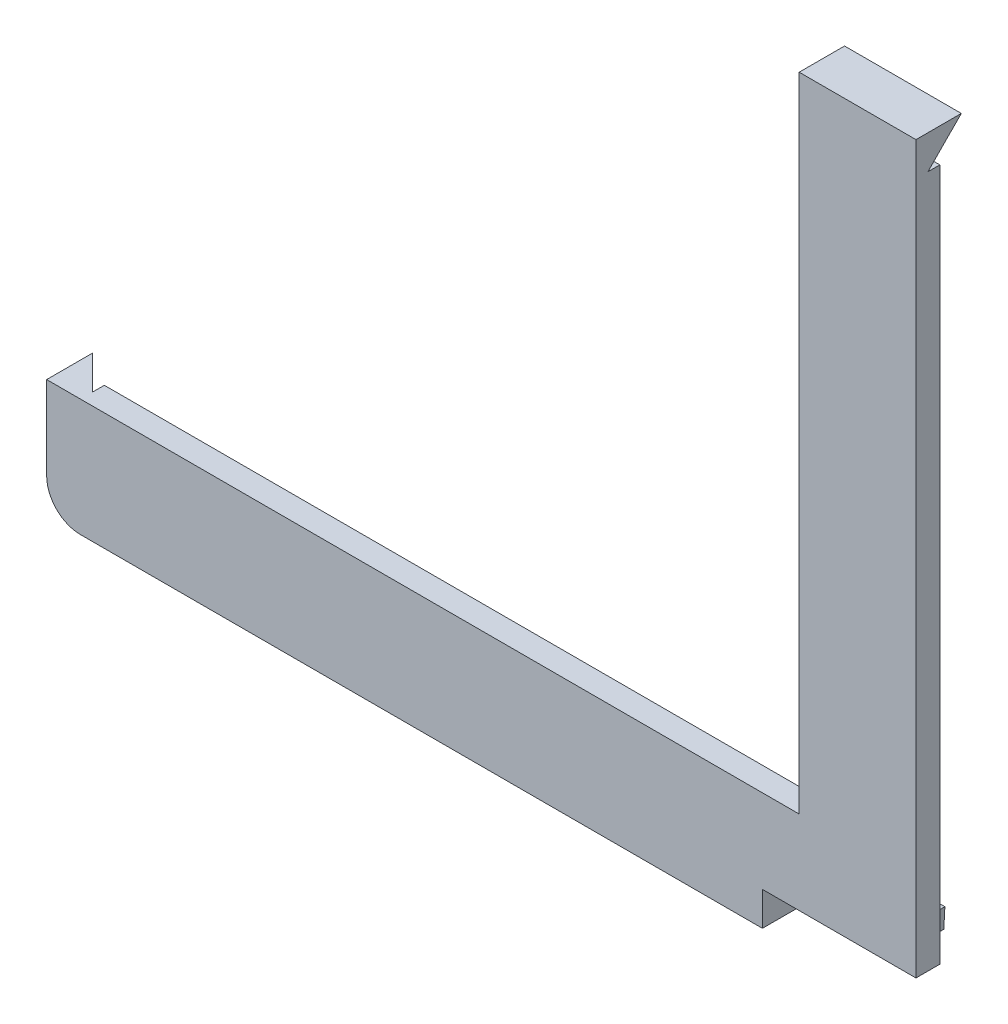
ISO-10303-21;
HEADER;
FILE_DESCRIPTION(('STEP AP214'),'2;1');
FILE_NAME('part.step','',(''),(''),'','','');
FILE_SCHEMA(('AUTOMOTIVE_DESIGN { 1 0 10303 214 1 1 1 1 }'));
ENDSEC;
DATA;
#1=APPLICATION_CONTEXT('core data for automotive mechanical design processes');
#2=APPLICATION_PROTOCOL_DEFINITION('international standard','automotive_design',2000,#1);
#3=PRODUCT_CONTEXT('',#1,'mechanical');
#4=PRODUCT('Part','Part','',(#3));
#5=PRODUCT_RELATED_PRODUCT_CATEGORY('part','',(#4));
#6=PRODUCT_DEFINITION_FORMATION('','',#4);
#7=PRODUCT_DEFINITION_CONTEXT('part definition',#1,'design');
#8=PRODUCT_DEFINITION('design','',#6,#7);
#9=PRODUCT_DEFINITION_SHAPE('','',#8);
#10=(LENGTH_UNIT() NAMED_UNIT(*) SI_UNIT(.MILLI.,.METRE.));
#11=(NAMED_UNIT(*) PLANE_ANGLE_UNIT() SI_UNIT($,.RADIAN.));
#12=(NAMED_UNIT(*) SI_UNIT($,.STERADIAN.) SOLID_ANGLE_UNIT());
#13=UNCERTAINTY_MEASURE_WITH_UNIT(LENGTH_MEASURE(1.E-05),#10,'distance_accuracy_value','');
#14=(GEOMETRIC_REPRESENTATION_CONTEXT(3) GLOBAL_UNCERTAINTY_ASSIGNED_CONTEXT((#13)) GLOBAL_UNIT_ASSIGNED_CONTEXT((#10,
#11,#12)) REPRESENTATION_CONTEXT('',''));
#15=CARTESIAN_POINT('',(0.,0.,0.));
#16=DIRECTION('',(0.,0.,1.));
#17=DIRECTION('',(1.,0.,0.));
#18=AXIS2_PLACEMENT_3D('',#15,#16,#17);
#19=CARTESIAN_POINT('',(0.,0.,2.39999941043331));
#20=DIRECTION('',(0.,0.,1.));
#21=DIRECTION('',(1.,0.,0.));
#22=AXIS2_PLACEMENT_3D('',#19,#20,#21);
#23=PLANE('',#22);
#24=DIRECTION('',(1.,0.,0.));
#25=VECTOR('',#24,1.);
#26=CARTESIAN_POINT('',(194.484495585411,-141.539185416974,2.39999941043331));
#27=LINE('',#26,#25);
#28=CARTESIAN_POINT('',(194.484495585411,-141.539185416974,2.39999941043331));
#29=VERTEX_POINT('',#28);
#30=CARTESIAN_POINT('',(334.487155431516,-141.539185416974,2.39999941043331));
#31=VERTEX_POINT('',#30);
#32=EDGE_CURVE('E252',#29,#31,#27,.T.);
#33=ORIENTED_EDGE('',*,*,#32,.F.);
#34=DIRECTION('',(0.,-1.,0.));
#35=VECTOR('',#34,1.);
#36=CARTESIAN_POINT('',(194.484495585411,-141.539185416974,2.39999941043331));
#37=LINE('',#36,#35);
#38=CARTESIAN_POINT('',(194.484495585411,-127.528304219109,2.39999941043331));
#39=VERTEX_POINT('',#38);
#40=EDGE_CURVE('E271',#39,#29,#37,.T.);
#41=ORIENTED_EDGE('',*,*,#40,.F.);
#42=DIRECTION('',(-1.,0.,0.));
#43=VECTOR('',#42,1.);
#44=CARTESIAN_POINT('',(194.484495585411,-127.528304219109,2.39999941043331));
#45=LINE('',#44,#43);
#46=CARTESIAN_POINT('',(314.919807207636,-127.528304219109,2.39999941043331));
#47=VERTEX_POINT('',#46);
#48=EDGE_CURVE('E268',#47,#39,#45,.T.);
#49=ORIENTED_EDGE('',*,*,#48,.F.);
#50=DIRECTION('',(0.,-1.,0.));
#51=VECTOR('',#50,1.);
#52=CARTESIAN_POINT('',(314.919807207636,-127.528304219109,2.39999941043331));
#53=LINE('',#52,#51);
#54=CARTESIAN_POINT('',(314.919807207636,-25.5391854169727,2.39999941043331));
#55=VERTEX_POINT('',#54);
#56=EDGE_CURVE('E265',#55,#47,#53,.T.);
#57=ORIENTED_EDGE('',*,*,#56,.F.);
#58=DIRECTION('',(-1.,0.,0.));
#59=VECTOR('',#58,1.);
#60=CARTESIAN_POINT('',(314.919807207636,-25.5391854169727,2.39999941043331));
#61=LINE('',#60,#59);
#62=CARTESIAN_POINT('',(334.487155431516,-25.5391854169739,2.39999941043331));
#63=VERTEX_POINT('',#62);
#64=EDGE_CURVE('E262',#63,#55,#61,.T.);
#65=ORIENTED_EDGE('',*,*,#64,.F.);
#66=DIRECTION('',(0.,1.,0.));
#67=VECTOR('',#66,1.);
#68=CARTESIAN_POINT('',(334.487155431516,-141.539185416974,2.39999941043331));
#69=LINE('',#68,#67);
#70=EDGE_CURVE('E259',#31,#63,#69,.T.);
#71=ORIENTED_EDGE('',*,*,#70,.F.);
#72=EDGE_LOOP('',(#33,#41,#49,#57,#65,#71));
#73=FACE_BOUND('',#72,.T.);
#74=DIRECTION('',(-0.0532857404575377,-0.998579305745864,0.));
#75=VECTOR('',#74,1.);
#76=CARTESIAN_POINT('',(332.752260863406,-138.539185416972,2.39999941043331));
#77=LINE('',#76,#75);
#78=CARTESIAN_POINT('',(332.932155431516,-135.167945918587,2.39999941043331));
#79=VERTEX_POINT('',#78);
#80=CARTESIAN_POINT('',(332.752260863406,-138.539185416972,2.39999941043331));
#81=VERTEX_POINT('',#80);
#82=EDGE_CURVE('E49',#79,#81,#77,.T.);
#83=ORIENTED_EDGE('',*,*,#82,.F.);
#84=DIRECTION('',(1.,0.,0.));
#85=VECTOR('',#84,1.);
#86=CARTESIAN_POINT('',(332.932155431516,-135.167945918587,2.39999941043331));
#87=LINE('',#86,#85);
#88=CARTESIAN_POINT('',(197.504878741066,-135.167945918587,2.39999941043331));
#89=VERTEX_POINT('',#88);
#90=EDGE_CURVE('E54',#89,#79,#87,.T.);
#91=ORIENTED_EDGE('',*,*,#90,.F.);
#92=DIRECTION('',(0.,1.,0.));
#93=VECTOR('',#92,1.);
#94=CARTESIAN_POINT('',(197.504878741066,-135.167945918587,2.39999941043331));
#95=LINE('',#94,#93);
#96=CARTESIAN_POINT('',(197.504878741066,-138.539185416974,2.39999941043331));
#97=VERTEX_POINT('',#96);
#98=EDGE_CURVE('E149',#97,#89,#95,.T.);
#99=ORIENTED_EDGE('',*,*,#98,.F.);
#100=DIRECTION('',(-1.,0.,0.));
#101=VECTOR('',#100,1.);
#102=CARTESIAN_POINT('',(197.504878741066,-138.539185416974,2.39999941043331));
#103=LINE('',#102,#101);
#104=EDGE_CURVE('E152',#81,#97,#103,.T.);
#105=ORIENTED_EDGE('',*,*,#104,.F.);
#106=EDGE_LOOP('',(#83,#91,#99,#105));
#107=FACE_BOUND('',#106,.T.);
#108=ADVANCED_FACE('F34',(#73,#107),#23,.F.);
#109=CARTESIAN_POINT('',(194.484495585411,-141.539185416974,6.39999941043331));
#110=DIRECTION('',(0.,1.,0.));
#111=DIRECTION('',(-1.,0.,0.));
#112=AXIS2_PLACEMENT_3D('',#109,#110,#111);
#113=PLANE('',#112);
#114=DIRECTION('',(-1.,0.,0.));
#115=VECTOR('',#114,1.);
#116=CARTESIAN_POINT('',(308.7576771933,-141.539185416974,4.39999941043331));
#117=LINE('',#116,#115);
#118=CARTESIAN_POINT('',(308.7576771933,-141.539185416974,4.39999941043306));
#119=VERTEX_POINT('',#118);
#120=CARTESIAN_POINT('',(194.484495585411,-141.539185416974,4.39999941043331));
#121=VERTEX_POINT('',#120);
#122=EDGE_CURVE('E215',#119,#121,#117,.T.);
#123=ORIENTED_EDGE('',*,*,#122,.T.);
#124=DIRECTION('',(0.,0.,-1.));
#125=VECTOR('',#124,1.);
#126=CARTESIAN_POINT('',(194.484495585411,-141.539185416974,6.39999941043331));
#127=LINE('',#126,#125);
#128=EDGE_CURVE('E282',#121,#29,#127,.T.);
#129=ORIENTED_EDGE('',*,*,#128,.T.);
#130=ORIENTED_EDGE('',*,*,#32,.T.);
#131=DIRECTION('',(0.,0.,-1.));
#132=VECTOR('',#131,1.);
#133=CARTESIAN_POINT('',(334.487155431516,-141.539185416974,6.39999941043331));
#134=LINE('',#133,#132);
#135=CARTESIAN_POINT('',(334.487155431516,-141.539185416974,6.39999941043331));
#136=VERTEX_POINT('',#135);
#137=EDGE_CURVE('E11',#136,#31,#134,.T.);
#138=ORIENTED_EDGE('',*,*,#137,.F.);
#139=DIRECTION('',(1.,0.,0.));
#140=VECTOR('',#139,1.);
#141=CARTESIAN_POINT('',(194.484495585411,-141.539185416974,6.39999941043331));
#142=LINE('',#141,#140);
#143=CARTESIAN_POINT('',(308.7576771933,-141.539185416974,6.39999941043331));
#144=VERTEX_POINT('',#143);
#145=EDGE_CURVE('E274',#144,#136,#142,.T.);
#146=ORIENTED_EDGE('',*,*,#145,.F.);
#147=DIRECTION('',(0.,0.,1.));
#148=VECTOR('',#147,1.);
#149=CARTESIAN_POINT('',(308.7576771933,-141.539185416974,4.39999941043331));
#150=LINE('',#149,#148);
#151=EDGE_CURVE('E212',#119,#144,#150,.T.);
#152=ORIENTED_EDGE('',*,*,#151,.F.);
#153=EDGE_LOOP('',(#123,#129,#130,#138,#146,#152));
#154=FACE_BOUND('',#153,.T.);
#155=ADVANCED_FACE('F36',(#154),#113,.F.);
#156=CARTESIAN_POINT('',(334.487155431516,-127.528304219109,6.39999941043331));
#157=DIRECTION('',(-1.,0.,0.));
#158=DIRECTION('',(0.,0.,1.));
#159=AXIS2_PLACEMENT_3D('',#156,#157,#158);
#160=PLANE('',#159);
#161=ORIENTED_EDGE('',*,*,#137,.T.);
#162=ORIENTED_EDGE('',*,*,#70,.T.);
#163=DIRECTION('',(0.,0.,-1.));
#164=VECTOR('',#163,1.);
#165=CARTESIAN_POINT('',(334.487155431516,-25.5391854169739,6.39999941043331));
#166=LINE('',#165,#164);
#167=CARTESIAN_POINT('',(334.487155431516,-25.5391854169739,4.39999941043331));
#168=VERTEX_POINT('',#167);
#169=EDGE_CURVE('E42',#168,#63,#166,.T.);
#170=ORIENTED_EDGE('',*,*,#169,.F.);
#171=DIRECTION('',(0.,0.710881939172019,-0.703311359611822));
#172=VECTOR('',#171,1.);
#173=CARTESIAN_POINT('',(334.487155431516,-25.5391854169739,4.39999941043331));
#174=LINE('',#173,#172);
#175=CARTESIAN_POINT('',(334.487155431516,-19.8778807442643,-1.20101486090637));
#176=VERTEX_POINT('',#175);
#177=EDGE_CURVE('E192',#168,#176,#174,.T.);
#178=ORIENTED_EDGE('',*,*,#177,.T.);
#179=DIRECTION('',(0.,0.,1.));
#180=VECTOR('',#179,1.);
#181=CARTESIAN_POINT('',(334.487155431516,-19.8778807442643,-1.20101486090637));
#182=LINE('',#181,#180);
#183=CARTESIAN_POINT('',(334.487155431516,-19.8778807442643,6.39999941043331));
#184=VERTEX_POINT('',#183);
#185=EDGE_CURVE('E188',#176,#184,#182,.T.);
#186=ORIENTED_EDGE('',*,*,#185,.T.);
#187=DIRECTION('',(0.,1.,0.));
#188=VECTOR('',#187,1.);
#189=CARTESIAN_POINT('',(334.487155431516,-141.539185416974,6.39999941043331));
#190=LINE('',#189,#188);
#191=EDGE_CURVE('E276',#136,#184,#190,.T.);
#192=ORIENTED_EDGE('',*,*,#191,.F.);
#193=EDGE_LOOP('',(#161,#162,#170,#178,#186,#192));
#194=FACE_BOUND('',#193,.T.);
#195=ADVANCED_FACE('F296',(#194),#160,.F.);
#196=CARTESIAN_POINT('',(314.919807207636,-25.5391854169727,6.39999941043331));
#197=DIRECTION('',(0.,-1.,0.));
#198=DIRECTION('',(1.,0.,0.));
#199=AXIS2_PLACEMENT_3D('',#196,#197,#198);
#200=PLANE('',#199);
#201=DIRECTION('',(0.,0.,-1.));
#202=VECTOR('',#201,1.);
#203=CARTESIAN_POINT('',(314.919807207636,-25.5391854169727,6.39999941043331));
#204=LINE('',#203,#202);
#205=CARTESIAN_POINT('',(314.919807207636,-25.5391854169739,4.39999941043331));
#206=VERTEX_POINT('',#205);
#207=EDGE_CURVE('E288',#206,#55,#204,.T.);
#208=ORIENTED_EDGE('',*,*,#207,.F.);
#209=DIRECTION('',(1.,0.,0.));
#210=VECTOR('',#209,1.);
#211=CARTESIAN_POINT('',(314.919807207636,-25.5391854169739,4.39999941043331));
#212=LINE('',#211,#210);
#213=EDGE_CURVE('E191',#206,#168,#212,.T.);
#214=ORIENTED_EDGE('',*,*,#213,.T.);
#215=ORIENTED_EDGE('',*,*,#169,.T.);
#216=ORIENTED_EDGE('',*,*,#64,.T.);
#217=EDGE_LOOP('',(#208,#214,#215,#216));
#218=FACE_BOUND('',#217,.T.);
#219=ADVANCED_FACE('F292',(#218),#200,.F.);
#220=CARTESIAN_POINT('',(314.919807207636,-127.528304219109,6.39999941043331));
#221=DIRECTION('',(1.,0.,0.));
#222=DIRECTION('',(0.,0.,-1.));
#223=AXIS2_PLACEMENT_3D('',#220,#221,#222);
#224=PLANE('',#223);
#225=DIRECTION('',(0.,-1.,0.));
#226=VECTOR('',#225,1.);
#227=CARTESIAN_POINT('',(314.919807207636,-127.528304219109,6.39999941043331));
#228=LINE('',#227,#226);
#229=CARTESIAN_POINT('',(314.919807207636,-19.8778807442643,6.39999941043331));
#230=VERTEX_POINT('',#229);
#231=CARTESIAN_POINT('',(314.919807207636,-127.528304219109,6.39999941043331));
#232=VERTEX_POINT('',#231);
#233=EDGE_CURVE('E278',#230,#232,#228,.T.);
#234=ORIENTED_EDGE('',*,*,#233,.F.);
#235=DIRECTION('',(0.,0.,1.));
#236=VECTOR('',#235,1.);
#237=CARTESIAN_POINT('',(314.919807207636,-19.8778807442643,-1.20101486090637));
#238=LINE('',#237,#236);
#239=CARTESIAN_POINT('',(314.919807207636,-19.8778807442643,-1.20101486090637));
#240=VERTEX_POINT('',#239);
#241=EDGE_CURVE('E187',#240,#230,#238,.T.);
#242=ORIENTED_EDGE('',*,*,#241,.F.);
#243=DIRECTION('',(0.,0.710881939172019,-0.703311359611822));
#244=VECTOR('',#243,1.);
#245=CARTESIAN_POINT('',(314.919807207636,-25.5391854169739,4.39999941043331));
#246=LINE('',#245,#244);
#247=EDGE_CURVE('E184',#206,#240,#246,.T.);
#248=ORIENTED_EDGE('',*,*,#247,.F.);
#249=ORIENTED_EDGE('',*,*,#207,.T.);
#250=ORIENTED_EDGE('',*,*,#56,.T.);
#251=DIRECTION('',(0.,0.,-1.));
#252=VECTOR('',#251,1.);
#253=CARTESIAN_POINT('',(314.919807207636,-127.528304219109,6.39999941043331));
#254=LINE('',#253,#252);
#255=EDGE_CURVE('E286',#232,#47,#254,.T.);
#256=ORIENTED_EDGE('',*,*,#255,.F.);
#257=EDGE_LOOP('',(#234,#242,#248,#249,#250,#256));
#258=FACE_BOUND('',#257,.T.);
#259=ADVANCED_FACE('F306',(#258),#224,.F.);
#260=CARTESIAN_POINT('',(194.484495585411,-127.528304219109,6.39999941043331));
#261=DIRECTION('',(0.,-1.,0.));
#262=DIRECTION('',(0.,0.,-1.));
#263=AXIS2_PLACEMENT_3D('',#260,#261,#262);
#264=PLANE('',#263);
#265=ORIENTED_EDGE('',*,*,#255,.T.);
#266=ORIENTED_EDGE('',*,*,#48,.T.);
#267=DIRECTION('',(0.,0.,-1.));
#268=VECTOR('',#267,1.);
#269=CARTESIAN_POINT('',(194.484495585411,-127.528304219109,6.39999941043331));
#270=LINE('',#269,#268);
#271=CARTESIAN_POINT('',(194.484495585411,-127.528304219109,4.39999941043331));
#272=VERTEX_POINT('',#271);
#273=EDGE_CURVE('E284',#272,#39,#270,.T.);
#274=ORIENTED_EDGE('',*,*,#273,.F.);
#275=DIRECTION('',(-0.706793245835998,0.,-0.707420177575261));
#276=VECTOR('',#275,1.);
#277=CARTESIAN_POINT('',(194.484495585411,-127.528304219109,4.39999941043331));
#278=LINE('',#277,#276);
#279=CARTESIAN_POINT('',(188.825701168851,-127.528304219109,-1.26381440585367));
#280=VERTEX_POINT('',#279);
#281=EDGE_CURVE('E236',#272,#280,#278,.T.);
#282=ORIENTED_EDGE('',*,*,#281,.T.);
#283=DIRECTION('',(0.,0.,1.));
#284=VECTOR('',#283,1.);
#285=CARTESIAN_POINT('',(188.825701168851,-127.528304219109,-1.26381440585367));
#286=LINE('',#285,#284);
#287=CARTESIAN_POINT('',(188.825701168851,-127.528304219109,6.39999941043331));
#288=VERTEX_POINT('',#287);
#289=EDGE_CURVE('E241',#280,#288,#286,.T.);
#290=ORIENTED_EDGE('',*,*,#289,.T.);
#291=DIRECTION('',(-1.,0.,0.));
#292=VECTOR('',#291,1.);
#293=CARTESIAN_POINT('',(194.484495585411,-127.528304219109,6.39999941043331));
#294=LINE('',#293,#292);
#295=EDGE_CURVE('E280',#232,#288,#294,.T.);
#296=ORIENTED_EDGE('',*,*,#295,.F.);
#297=EDGE_LOOP('',(#265,#266,#274,#282,#290,#296));
#298=FACE_BOUND('',#297,.T.);
#299=ADVANCED_FACE('F335',(#298),#264,.F.);
#300=CARTESIAN_POINT('',(194.484495585411,-141.539185416974,6.39999941043331));
#301=DIRECTION('',(1.,0.,0.));
#302=DIRECTION('',(0.,1.,0.));
#303=AXIS2_PLACEMENT_3D('',#300,#301,#302);
#304=PLANE('',#303);
#305=ORIENTED_EDGE('',*,*,#128,.F.);
#306=DIRECTION('',(0.,1.,0.));
#307=VECTOR('',#306,1.);
#308=CARTESIAN_POINT('',(194.484495585411,-141.539185416974,4.39999941043331));
#309=LINE('',#308,#307);
#310=EDGE_CURVE('E244',#121,#272,#309,.T.);
#311=ORIENTED_EDGE('',*,*,#310,.T.);
#312=ORIENTED_EDGE('',*,*,#273,.T.);
#313=ORIENTED_EDGE('',*,*,#40,.T.);
#314=EDGE_LOOP('',(#305,#311,#312,#313));
#315=FACE_BOUND('',#314,.T.);
#316=ADVANCED_FACE('F332',(#315),#304,.F.);
#317=CARTESIAN_POINT('',(0.,0.,6.39999941043331));
#318=DIRECTION('',(0.,0.,1.));
#319=DIRECTION('',(1.,0.,0.));
#320=AXIS2_PLACEMENT_3D('',#317,#318,#319);
#321=PLANE('',#320);
#322=DIRECTION('',(0.,-1.,0.));
#323=VECTOR('',#322,1.);
#324=CARTESIAN_POINT('',(308.7576771933,-141.539185416974,6.39999941043331));
#325=LINE('',#324,#323);
#326=CARTESIAN_POINT('',(308.7576771933,-147.197979833533,6.39999941043331));
#327=VERTEX_POINT('',#326);
#328=EDGE_CURVE('E200',#144,#327,#325,.T.);
#329=ORIENTED_EDGE('',*,*,#328,.F.);
#330=ORIENTED_EDGE('',*,*,#145,.T.);
#331=ORIENTED_EDGE('',*,*,#191,.T.);
#332=DIRECTION('',(1.,0.,0.));
#333=VECTOR('',#332,1.);
#334=CARTESIAN_POINT('',(314.919807207636,-19.8778807442643,6.39999941043331));
#335=LINE('',#334,#333);
#336=EDGE_CURVE('E197',#230,#184,#335,.T.);
#337=ORIENTED_EDGE('',*,*,#336,.F.);
#338=ORIENTED_EDGE('',*,*,#233,.T.);
#339=ORIENTED_EDGE('',*,*,#295,.T.);
#340=DIRECTION('',(0.,1.,0.));
#341=VECTOR('',#340,1.);
#342=CARTESIAN_POINT('',(188.825701168851,-141.539185416974,6.39999941043331));
#343=LINE('',#342,#341);
#344=CARTESIAN_POINT('',(188.825701168851,-141.539185416974,6.39999941043331));
#345=VERTEX_POINT('',#344);
#346=EDGE_CURVE('E249',#345,#288,#343,.T.);
#347=ORIENTED_EDGE('',*,*,#346,.F.);
#348=CARTESIAN_POINT('',(194.484495585411,-141.539185416974,6.39999941043331));
#349=DIRECTION('',(0.,0.,-1.));
#350=DIRECTION('',(-1.,0.,0.));
#351=AXIS2_PLACEMENT_3D('',#348,#349,#350);
#352=CIRCLE('',#351,5.65879441655923);
#353=CARTESIAN_POINT('',(194.484495585411,-147.197979833533,6.39999941043331));
#354=VERTEX_POINT('',#353);
#355=EDGE_CURVE('E233',#354,#345,#352,.T.);
#356=ORIENTED_EDGE('',*,*,#355,.F.);
#357=DIRECTION('',(-1.,0.,0.));
#358=VECTOR('',#357,1.);
#359=CARTESIAN_POINT('',(308.7576771933,-147.197979833533,6.39999941043331));
#360=LINE('',#359,#358);
#361=EDGE_CURVE('E221',#327,#354,#360,.T.);
#362=ORIENTED_EDGE('',*,*,#361,.F.);
#363=EDGE_LOOP('',(#329,#330,#331,#337,#338,#339,#347,#356,#362));
#364=FACE_BOUND('',#363,.T.);
#365=ADVANCED_FACE('F318',(#364),#321,.T.);
#366=CARTESIAN_POINT('',(188.825701168851,-141.539185416974,-1.26381440585367));
#367=DIRECTION('',(-1.,0.,0.));
#368=DIRECTION('',(0.,0.,1.));
#369=AXIS2_PLACEMENT_3D('',#366,#367,#368);
#370=PLANE('',#369);
#371=ORIENTED_EDGE('',*,*,#289,.F.);
#372=DIRECTION('',(0.,1.,0.));
#373=VECTOR('',#372,1.);
#374=CARTESIAN_POINT('',(188.825701168851,-141.539185416974,-1.26381440585367));
#375=LINE('',#374,#373);
#376=CARTESIAN_POINT('',(188.825701168851,-141.539185416974,-1.26381440585367));
#377=VERTEX_POINT('',#376);
#378=EDGE_CURVE('E253',#377,#280,#375,.T.);
#379=ORIENTED_EDGE('',*,*,#378,.F.);
#380=DIRECTION('',(0.,0.,1.));
#381=VECTOR('',#380,1.);
#382=CARTESIAN_POINT('',(188.825701168851,-141.539185416974,-1.26381440585367));
#383=LINE('',#382,#381);
#384=EDGE_CURVE('E240',#377,#345,#383,.T.);
#385=ORIENTED_EDGE('',*,*,#384,.T.);
#386=ORIENTED_EDGE('',*,*,#346,.T.);
#387=EDGE_LOOP('',(#371,#379,#385,#386));
#388=FACE_BOUND('',#387,.T.);
#389=ADVANCED_FACE('F338',(#388),#370,.T.);
#390=CARTESIAN_POINT('',(194.484495585411,-141.539185416974,4.39999941043331));
#391=DIRECTION('',(0.707420177575262,0.,-0.706793245835998));
#392=DIRECTION('',(-0.706793245835998,0.,-0.707420177575262));
#393=AXIS2_PLACEMENT_3D('',#390,#391,#392);
#394=PLANE('',#393);
#395=ORIENTED_EDGE('',*,*,#281,.F.);
#396=ORIENTED_EDGE('',*,*,#310,.F.);
#397=DIRECTION('',(-0.706793245835998,0.,-0.707420177575261));
#398=VECTOR('',#397,1.);
#399=CARTESIAN_POINT('',(194.484495585411,-141.539185416974,4.39999941043331));
#400=LINE('',#399,#398);
#401=EDGE_CURVE('E237',#121,#377,#400,.T.);
#402=ORIENTED_EDGE('',*,*,#401,.T.);
#403=ORIENTED_EDGE('',*,*,#378,.T.);
#404=EDGE_LOOP('',(#395,#396,#402,#403));
#405=FACE_BOUND('',#404,.T.);
#406=ADVANCED_FACE('F363',(#405),#394,.T.);
#407=CARTESIAN_POINT('',(194.484495585411,-141.539185416974,4.39999941043331));
#408=DIRECTION('',(0.,0.,-1.));
#409=DIRECTION('',(-1.,0.,0.));
#410=AXIS2_PLACEMENT_3D('',#407,#408,#409);
#411=CYLINDRICAL_SURFACE('',#410,5.65879441655923);
#412=ORIENTED_EDGE('',*,*,#355,.T.);
#413=ORIENTED_EDGE('',*,*,#384,.F.);
#414=CARTESIAN_POINT('',(194.484495585411,-141.539185416974,-1.26381440585367));
#415=DIRECTION('',(0.,0.,-1.));
#416=DIRECTION('',(-1.,0.,0.));
#417=AXIS2_PLACEMENT_3D('',#414,#415,#416);
#418=CIRCLE('',#417,5.65879441655923);
#419=CARTESIAN_POINT('',(194.484495585411,-147.197979833533,-1.26381440585367));
#420=VERTEX_POINT('',#419);
#421=EDGE_CURVE('E230',#420,#377,#418,.T.);
#422=ORIENTED_EDGE('',*,*,#421,.F.);
#423=DIRECTION('',(0.,0.,-1.));
#424=VECTOR('',#423,1.);
#425=CARTESIAN_POINT('',(194.484495585411,-147.197979833533,6.39999941043331));
#426=LINE('',#425,#424);
#427=EDGE_CURVE('E224',#354,#420,#426,.T.);
#428=ORIENTED_EDGE('',*,*,#427,.F.);
#429=EDGE_LOOP('',(#412,#413,#422,#428));
#430=FACE_BOUND('',#429,.T.);
#431=ADVANCED_FACE('F342',(#430),#411,.T.);
#432=CARTESIAN_POINT('',(194.484495585411,-141.539185416974,-1.26381440585367));
#433=DIRECTION('',(0.,0.,-1.));
#434=DIRECTION('',(-1.,0.,0.));
#435=AXIS2_PLACEMENT_3D('',#432,#433,#434);
#436=CONICAL_SURFACE('',#435,5.65879441655923,0.784954855698748);
#437=DIRECTION('',(0.,0.706793245835998,0.707420177575261));
#438=VECTOR('',#437,1.);
#439=CARTESIAN_POINT('',(194.484495585411,-147.197979833533,-1.26381440585367));
#440=LINE('',#439,#438);
#441=EDGE_CURVE('E227',#420,#121,#440,.T.);
#442=ORIENTED_EDGE('',*,*,#441,.F.);
#443=ORIENTED_EDGE('',*,*,#421,.T.);
#444=ORIENTED_EDGE('',*,*,#401,.F.);
#445=EDGE_LOOP('',(#442,#443,#444));
#446=FACE_BOUND('',#445,.T.);
#447=ADVANCED_FACE('F346',(#446),#436,.F.);
#448=CARTESIAN_POINT('',(308.7576771933,-147.197979833533,6.39999941043331));
#449=DIRECTION('',(0.,1.,0.));
#450=DIRECTION('',(-1.,0.,0.));
#451=AXIS2_PLACEMENT_3D('',#448,#449,#450);
#452=PLANE('',#451);
#453=ORIENTED_EDGE('',*,*,#427,.T.);
#454=DIRECTION('',(-1.,0.,0.));
#455=VECTOR('',#454,1.);
#456=CARTESIAN_POINT('',(308.7576771933,-147.197979833533,-1.26381440585367));
#457=LINE('',#456,#455);
#458=CARTESIAN_POINT('',(308.7576771933,-147.197979833533,-1.26381440585367));
#459=VERTEX_POINT('',#458);
#460=EDGE_CURVE('E218',#459,#420,#457,.T.);
#461=ORIENTED_EDGE('',*,*,#460,.F.);
#462=DIRECTION('',(0.,0.,-1.));
#463=VECTOR('',#462,1.);
#464=CARTESIAN_POINT('',(308.7576771933,-147.197979833533,6.39999941043331));
#465=LINE('',#464,#463);
#466=EDGE_CURVE('E207',#327,#459,#465,.T.);
#467=ORIENTED_EDGE('',*,*,#466,.F.);
#468=ORIENTED_EDGE('',*,*,#361,.T.);
#469=EDGE_LOOP('',(#453,#461,#467,#468));
#470=FACE_BOUND('',#469,.T.);
#471=ADVANCED_FACE('F344',(#470),#452,.F.);
#472=CARTESIAN_POINT('',(308.7576771933,-147.197979833533,-1.26381440585367));
#473=DIRECTION('',(0.,-0.707420177575263,0.706793245835996));
#474=DIRECTION('',(0.,-0.706793245835996,-0.707420177575263));
#475=AXIS2_PLACEMENT_3D('',#472,#473,#474);
#476=PLANE('',#475);
#477=ORIENTED_EDGE('',*,*,#441,.T.);
#478=ORIENTED_EDGE('',*,*,#122,.F.);
#479=DIRECTION('',(0.,0.706793245835996,0.707420177575263));
#480=VECTOR('',#479,1.);
#481=CARTESIAN_POINT('',(308.7576771933,-147.197979833533,-1.26381440585367));
#482=LINE('',#481,#480);
#483=EDGE_CURVE('E209',#459,#119,#482,.T.);
#484=ORIENTED_EDGE('',*,*,#483,.F.);
#485=ORIENTED_EDGE('',*,*,#460,.T.);
#486=EDGE_LOOP('',(#477,#478,#484,#485));
#487=FACE_BOUND('',#486,.T.);
#488=ADVANCED_FACE('F327',(#487),#476,.F.);
#489=CARTESIAN_POINT('',(308.7576771933,1.35290125915831E-12,0.));
#490=DIRECTION('',(1.,0.,0.));
#491=DIRECTION('',(0.,1.,0.));
#492=AXIS2_PLACEMENT_3D('',#489,#490,#491);
#493=PLANE('',#492);
#494=ORIENTED_EDGE('',*,*,#328,.T.);
#495=ORIENTED_EDGE('',*,*,#466,.T.);
#496=ORIENTED_EDGE('',*,*,#483,.T.);
#497=ORIENTED_EDGE('',*,*,#151,.T.);
#498=EDGE_LOOP('',(#494,#495,#496,#497));
#499=FACE_BOUND('',#498,.T.);
#500=ADVANCED_FACE('F322',(#499),#493,.T.);
#501=CARTESIAN_POINT('',(314.919807207636,-19.8778807442643,-1.20101486090637));
#502=DIRECTION('',(0.,1.,0.));
#503=DIRECTION('',(0.,0.,1.));
#504=AXIS2_PLACEMENT_3D('',#501,#502,#503);
#505=PLANE('',#504);
#506=ORIENTED_EDGE('',*,*,#185,.F.);
#507=DIRECTION('',(1.,0.,0.));
#508=VECTOR('',#507,1.);
#509=CARTESIAN_POINT('',(314.919807207636,-19.8778807442643,-1.20101486090637));
#510=LINE('',#509,#508);
#511=EDGE_CURVE('E201',#240,#176,#510,.T.);
#512=ORIENTED_EDGE('',*,*,#511,.F.);
#513=ORIENTED_EDGE('',*,*,#241,.T.);
#514=ORIENTED_EDGE('',*,*,#336,.T.);
#515=EDGE_LOOP('',(#506,#512,#513,#514));
#516=FACE_BOUND('',#515,.T.);
#517=ADVANCED_FACE('F314',(#516),#505,.T.);
#518=CARTESIAN_POINT('',(314.919807207636,-25.5391854169739,4.39999941043331));
#519=DIRECTION('',(0.,-0.703311359611822,-0.710881939172019));
#520=DIRECTION('',(0.,0.710881939172019,-0.703311359611822));
#521=AXIS2_PLACEMENT_3D('',#518,#519,#520);
#522=PLANE('',#521);
#523=ORIENTED_EDGE('',*,*,#177,.F.);
#524=ORIENTED_EDGE('',*,*,#213,.F.);
#525=ORIENTED_EDGE('',*,*,#247,.T.);
#526=ORIENTED_EDGE('',*,*,#511,.T.);
#527=EDGE_LOOP('',(#523,#524,#525,#526));
#528=FACE_BOUND('',#527,.T.);
#529=ADVANCED_FACE('F311',(#528),#522,.T.);
#530=CARTESIAN_POINT('',(332.752260863406,-138.539185416972,-135.469230925502));
#531=DIRECTION('',(-0.998579305745864,0.0532857404575377,0.));
#532=DIRECTION('',(-0.0532857404575377,-0.998579305745864,0.));
#533=AXIS2_PLACEMENT_3D('',#530,#531,#532);
#534=PLANE('',#533);
#535=DIRECTION('',(0.,0.,1.));
#536=VECTOR('',#535,1.);
#537=CARTESIAN_POINT('',(332.752260863406,-138.539185416972,-135.469230925502));
#538=LINE('',#537,#536);
#539=CARTESIAN_POINT('',(332.752260863406,-138.539185416972,0.));
#540=VERTEX_POINT('',#539);
#541=EDGE_CURVE('E169',#540,#81,#538,.T.);
#542=ORIENTED_EDGE('',*,*,#541,.F.);
#543=DIRECTION('',(0.0532857404575377,0.998579305745864,0.));
#544=VECTOR('',#543,1.);
#545=CARTESIAN_POINT('',(332.752260863406,-138.539185416972,0.));
#546=LINE('',#545,#544);
#547=CARTESIAN_POINT('',(332.932155431516,-135.167945918587,0.));
#548=VERTEX_POINT('',#547);
#549=EDGE_CURVE('E164',#540,#548,#546,.T.);
#550=ORIENTED_EDGE('',*,*,#549,.T.);
#551=DIRECTION('',(0.,0.,1.));
#552=VECTOR('',#551,1.);
#553=CARTESIAN_POINT('',(332.932155431516,-135.167945918587,-135.469230925502));
#554=LINE('',#553,#552);
#555=EDGE_CURVE('E178',#548,#79,#554,.T.);
#556=ORIENTED_EDGE('',*,*,#555,.T.);
#557=ORIENTED_EDGE('',*,*,#82,.T.);
#558=EDGE_LOOP('',(#542,#550,#556,#557));
#559=FACE_BOUND('',#558,.T.);
#560=ADVANCED_FACE('F453',(#559),#534,.F.);
#561=CARTESIAN_POINT('',(332.932155431516,-135.167945918587,-135.469230925502));
#562=DIRECTION('',(0.,-1.,0.));
#563=DIRECTION('',(0.,0.,-1.));
#564=AXIS2_PLACEMENT_3D('',#561,#562,#563);
#565=PLANE('',#564);
#566=ORIENTED_EDGE('',*,*,#555,.F.);
#567=DIRECTION('',(-1.,0.,0.));
#568=VECTOR('',#567,1.);
#569=CARTESIAN_POINT('',(332.932155431516,-135.167945918587,0.));
#570=LINE('',#569,#568);
#571=CARTESIAN_POINT('',(197.504878741066,-135.167945918587,0.));
#572=VERTEX_POINT('',#571);
#573=EDGE_CURVE('E183',#548,#572,#570,.T.);
#574=ORIENTED_EDGE('',*,*,#573,.T.);
#575=DIRECTION('',(0.,0.,1.));
#576=VECTOR('',#575,1.);
#577=CARTESIAN_POINT('',(197.504878741066,-135.167945918587,-135.469230925502));
#578=LINE('',#577,#576);
#579=EDGE_CURVE('E165',#572,#89,#578,.T.);
#580=ORIENTED_EDGE('',*,*,#579,.T.);
#581=ORIENTED_EDGE('',*,*,#90,.T.);
#582=EDGE_LOOP('',(#566,#574,#580,#581));
#583=FACE_BOUND('',#582,.T.);
#584=ADVANCED_FACE('F460',(#583),#565,.F.);
#585=CARTESIAN_POINT('',(197.504878741066,-135.167945918587,-135.469230925502));
#586=DIRECTION('',(1.,0.,0.));
#587=DIRECTION('',(0.,1.,0.));
#588=AXIS2_PLACEMENT_3D('',#585,#586,#587);
#589=PLANE('',#588);
#590=ORIENTED_EDGE('',*,*,#579,.F.);
#591=DIRECTION('',(0.,-1.,0.));
#592=VECTOR('',#591,1.);
#593=CARTESIAN_POINT('',(197.504878741066,-135.167945918587,0.));
#594=LINE('',#593,#592);
#595=CARTESIAN_POINT('',(197.504878741066,-138.539185416974,0.));
#596=VERTEX_POINT('',#595);
#597=EDGE_CURVE('E161',#572,#596,#594,.T.);
#598=ORIENTED_EDGE('',*,*,#597,.T.);
#599=DIRECTION('',(0.,0.,1.));
#600=VECTOR('',#599,1.);
#601=CARTESIAN_POINT('',(197.504878741066,-138.539185416974,-135.469230925502));
#602=LINE('',#601,#600);
#603=EDGE_CURVE('E159',#596,#97,#602,.T.);
#604=ORIENTED_EDGE('',*,*,#603,.T.);
#605=ORIENTED_EDGE('',*,*,#98,.T.);
#606=EDGE_LOOP('',(#590,#598,#604,#605));
#607=FACE_BOUND('',#606,.T.);
#608=ADVANCED_FACE('F160',(#607),#589,.F.);
#609=CARTESIAN_POINT('',(197.504878741066,-138.539185416974,-135.469230925502));
#610=DIRECTION('',(0.,1.,0.));
#611=DIRECTION('',(-1.,0.,0.));
#612=AXIS2_PLACEMENT_3D('',#609,#610,#611);
#613=PLANE('',#612);
#614=ORIENTED_EDGE('',*,*,#603,.F.);
#615=DIRECTION('',(1.,0.,0.));
#616=VECTOR('',#615,1.);
#617=CARTESIAN_POINT('',(197.504878741066,-138.539185416974,0.));
#618=LINE('',#617,#616);
#619=EDGE_CURVE('E172',#596,#540,#618,.T.);
#620=ORIENTED_EDGE('',*,*,#619,.T.);
#621=ORIENTED_EDGE('',*,*,#541,.T.);
#622=ORIENTED_EDGE('',*,*,#104,.T.);
#623=EDGE_LOOP('',(#614,#620,#621,#622));
#624=FACE_BOUND('',#623,.T.);
#625=ADVANCED_FACE('F167',(#624),#613,.F.);
#626=CARTESIAN_POINT('',(264.487155431516,-83.5391854169739,0.));
#627=DIRECTION('',(0.,0.,1.));
#628=DIRECTION('',(1.,0.,0.));
#629=AXIS2_PLACEMENT_3D('',#626,#627,#628);
#630=PLANE('',#629);
#631=ORIENTED_EDGE('',*,*,#597,.F.);
#632=ORIENTED_EDGE('',*,*,#573,.F.);
#633=ORIENTED_EDGE('',*,*,#549,.F.);
#634=ORIENTED_EDGE('',*,*,#619,.F.);
#635=EDGE_LOOP('',(#631,#632,#633,#634));
#636=FACE_BOUND('',#635,.T.);
#637=ADVANCED_FACE('F481',(#636),#630,.F.);
#638=CLOSED_SHELL('',(#108,#155,#195,#219,#259,#299,#316,#365,#389,#406,#431,#447,#471,#488,
#500,#517,#529,#560,#584,#608,#625,#637));
#639=MANIFOLD_SOLID_BREP('B2',#638);
#640=ADVANCED_BREP_SHAPE_REPRESENTATION('',(#18,#639),#14);
#641=SHAPE_DEFINITION_REPRESENTATION(#9,#640);
ENDSEC;
END-ISO-10303-21;
